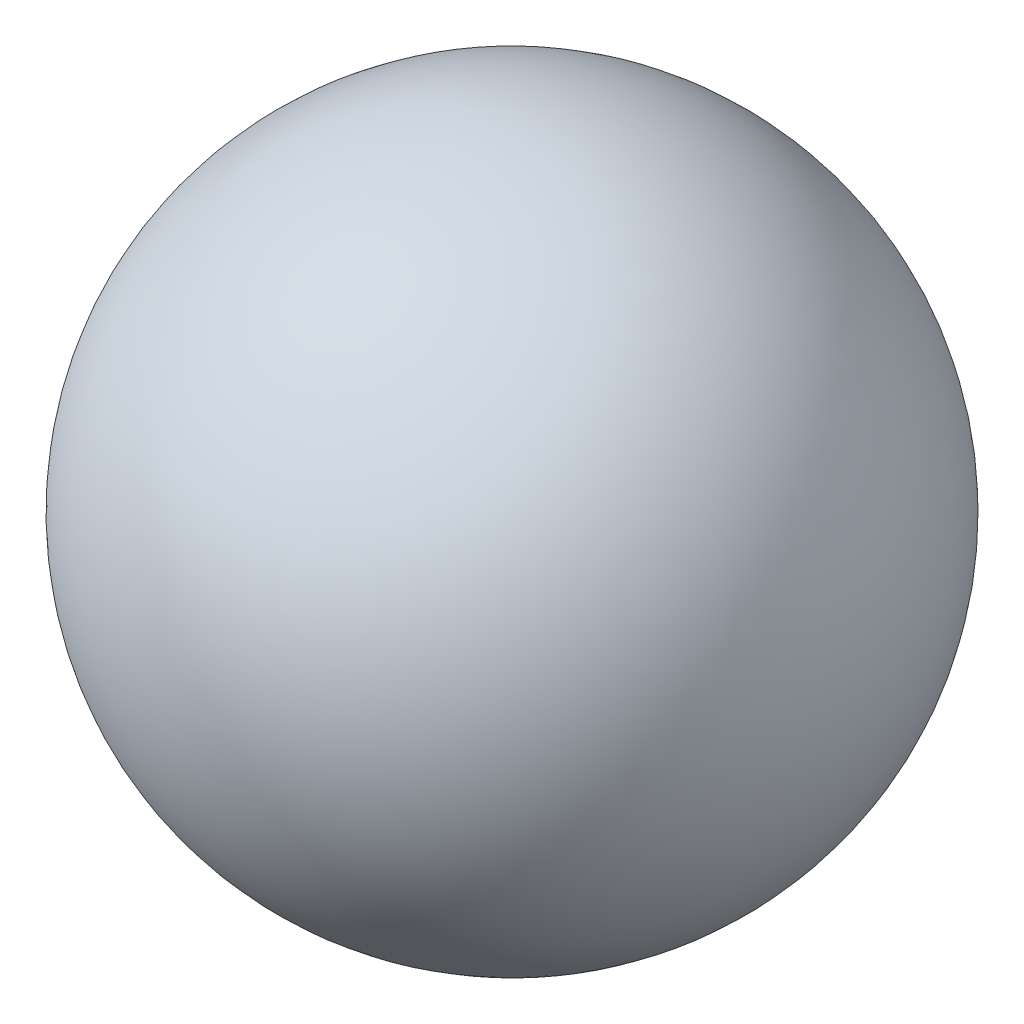
ISO-10303-21;
HEADER;
FILE_DESCRIPTION(('STEP AP214'),'2;1');
FILE_NAME('part.step','',(''),(''),'','','');
FILE_SCHEMA(('AUTOMOTIVE_DESIGN { 1 0 10303 214 1 1 1 1 }'));
ENDSEC;
DATA;
#1=APPLICATION_CONTEXT('core data for automotive mechanical design processes');
#2=APPLICATION_PROTOCOL_DEFINITION('international standard','automotive_design',2000,#1);
#3=PRODUCT_CONTEXT('',#1,'mechanical');
#4=PRODUCT('Part','Part','',(#3));
#5=PRODUCT_RELATED_PRODUCT_CATEGORY('part','',(#4));
#6=PRODUCT_DEFINITION_FORMATION('','',#4);
#7=PRODUCT_DEFINITION_CONTEXT('part definition',#1,'design');
#8=PRODUCT_DEFINITION('design','',#6,#7);
#9=PRODUCT_DEFINITION_SHAPE('','',#8);
#10=(LENGTH_UNIT() NAMED_UNIT(*) SI_UNIT(.MILLI.,.METRE.));
#11=(NAMED_UNIT(*) PLANE_ANGLE_UNIT() SI_UNIT($,.RADIAN.));
#12=(NAMED_UNIT(*) SI_UNIT($,.STERADIAN.) SOLID_ANGLE_UNIT());
#13=UNCERTAINTY_MEASURE_WITH_UNIT(LENGTH_MEASURE(1.E-05),#10,'distance_accuracy_value','');
#14=(GEOMETRIC_REPRESENTATION_CONTEXT(3) GLOBAL_UNCERTAINTY_ASSIGNED_CONTEXT((#13)) GLOBAL_UNIT_ASSIGNED_CONTEXT((#10,
#11,#12)) REPRESENTATION_CONTEXT('',''));
#15=CARTESIAN_POINT('',(0.,0.,0.));
#16=DIRECTION('',(0.,0.,1.));
#17=DIRECTION('',(1.,0.,0.));
#18=AXIS2_PLACEMENT_3D('',#15,#16,#17);
#19=CARTESIAN_POINT('',(49.75,52.8423703248095,4.07809988912632));
#20=DIRECTION('',(0.,0.997035261178115,0.0769460068326364));
#21=DIRECTION('',(0.173648177666934,-0.0757770240921106,0.981888055234759));
#22=AXIS2_PLACEMENT_3D('',#19,#20,#21);
#23=SPHERICAL_SURFACE('',#22,5.95);
#24=CARTESIAN_POINT('',(49.75,46.9100105207997,3.62027114847213));
#25=VERTEX_POINT('',#24);
#26=VERTEX_LOOP('',#25);
#27=FACE_BOUND('',#26,.T.);
#28=CARTESIAN_POINT('',(49.75,58.7747301288193,4.53592862978051));
#29=VERTEX_POINT('',#28);
#30=VERTEX_LOOP('',#29);
#31=FACE_BOUND('',#30,.T.);
#32=ADVANCED_FACE('F16',(#27,#31),#23,.T.);
#33=CLOSED_SHELL('',(#32));
#34=MANIFOLD_SOLID_BREP('B1',#33);
#35=ADVANCED_BREP_SHAPE_REPRESENTATION('',(#18,#34),#14);
#36=SHAPE_DEFINITION_REPRESENTATION(#9,#35);
ENDSEC;
END-ISO-10303-21;
